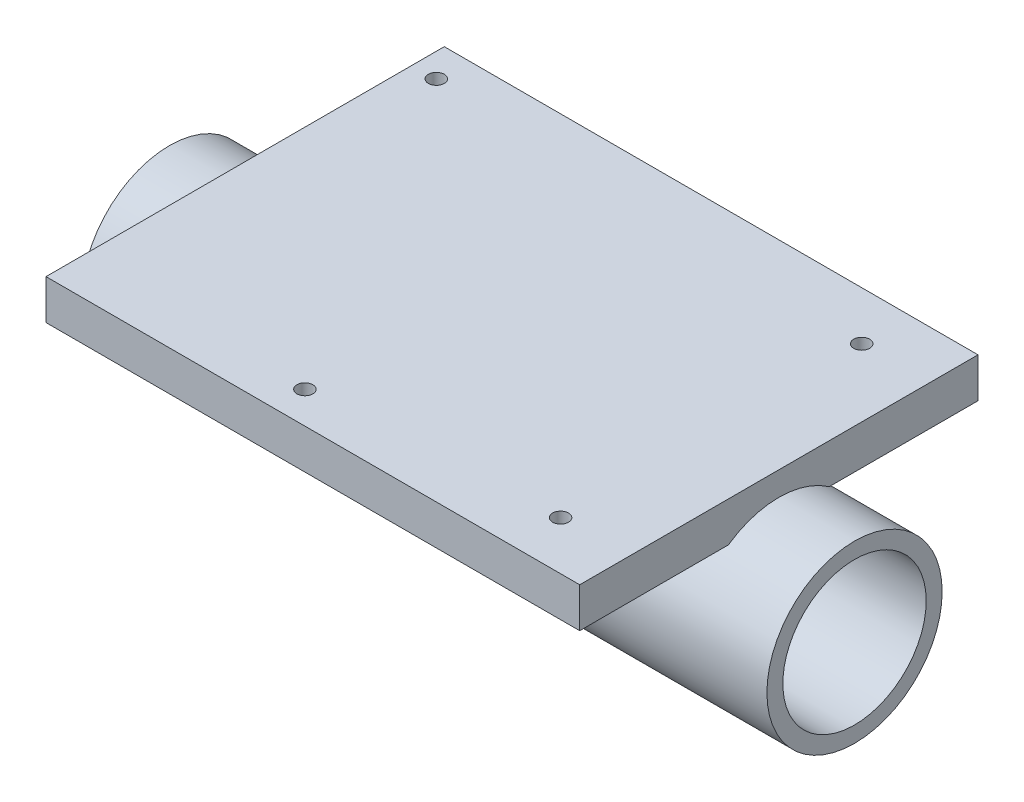
ISO-10303-21;
HEADER;
FILE_DESCRIPTION(('STEP AP214'),'2;1');
FILE_NAME('part.step','',(''),(''),'','','');
FILE_SCHEMA(('AUTOMOTIVE_DESIGN { 1 0 10303 214 1 1 1 1 }'));
ENDSEC;
DATA;
#1=APPLICATION_CONTEXT('core data for automotive mechanical design processes');
#2=APPLICATION_PROTOCOL_DEFINITION('international standard','automotive_design',2000,#1);
#3=PRODUCT_CONTEXT('',#1,'mechanical');
#4=PRODUCT('Part','Part','',(#3));
#5=PRODUCT_RELATED_PRODUCT_CATEGORY('part','',(#4));
#6=PRODUCT_DEFINITION_FORMATION('','',#4);
#7=PRODUCT_DEFINITION_CONTEXT('part definition',#1,'design');
#8=PRODUCT_DEFINITION('design','',#6,#7);
#9=PRODUCT_DEFINITION_SHAPE('','',#8);
#10=(LENGTH_UNIT() NAMED_UNIT(*) SI_UNIT(.MILLI.,.METRE.));
#11=(NAMED_UNIT(*) PLANE_ANGLE_UNIT() SI_UNIT($,.RADIAN.));
#12=(NAMED_UNIT(*) SI_UNIT($,.STERADIAN.) SOLID_ANGLE_UNIT());
#13=UNCERTAINTY_MEASURE_WITH_UNIT(LENGTH_MEASURE(1.E-05),#10,'distance_accuracy_value','');
#14=(GEOMETRIC_REPRESENTATION_CONTEXT(3) GLOBAL_UNCERTAINTY_ASSIGNED_CONTEXT((#13)) GLOBAL_UNIT_ASSIGNED_CONTEXT((#10,
#11,#12)) REPRESENTATION_CONTEXT('',''));
#15=CARTESIAN_POINT('',(0.,0.,0.));
#16=DIRECTION('',(0.,0.,1.));
#17=DIRECTION('',(1.,0.,0.));
#18=AXIS2_PLACEMENT_3D('',#15,#16,#17);
#19=CARTESIAN_POINT('',(43.,-9.,0.));
#20=DIRECTION('',(1.,0.,0.));
#21=DIRECTION('',(0.,0.,-1.));
#22=AXIS2_PLACEMENT_3D('',#19,#20,#21);
#23=PLANE('',#22);
#24=CARTESIAN_POINT('',(43.,-9.,0.));
#25=DIRECTION('',(1.,0.,0.));
#26=DIRECTION('',(0.,0.,-1.));
#27=AXIS2_PLACEMENT_3D('',#24,#25,#26);
#28=CIRCLE('',#27,11.);
#29=CARTESIAN_POINT('',(43.,-9.,-11.));
#30=VERTEX_POINT('',#29);
#31=EDGE_CURVE('E11',#30,#30,#28,.T.);
#32=ORIENTED_EDGE('',*,*,#31,.T.);
#33=EDGE_LOOP('',(#32));
#34=FACE_BOUND('',#33,.T.);
#35=CARTESIAN_POINT('',(43.,-9.,0.));
#36=DIRECTION('',(1.,0.,0.));
#37=DIRECTION('',(0.,0.,-1.));
#38=AXIS2_PLACEMENT_3D('',#35,#36,#37);
#39=CIRCLE('',#38,9.);
#40=CARTESIAN_POINT('',(43.,-9.,-9.));
#41=VERTEX_POINT('',#40);
#42=EDGE_CURVE('E58',#41,#41,#39,.T.);
#43=ORIENTED_EDGE('',*,*,#42,.F.);
#44=EDGE_LOOP('',(#43));
#45=FACE_BOUND('',#44,.T.);
#46=ADVANCED_FACE('F47',(#34,#45),#23,.T.);
#47=CARTESIAN_POINT('',(-43.,-9.,0.));
#48=DIRECTION('',(1.,0.,0.));
#49=DIRECTION('',(0.,0.,-1.));
#50=AXIS2_PLACEMENT_3D('',#47,#48,#49);
#51=PLANE('',#50);
#52=CARTESIAN_POINT('',(-43.,-9.,0.));
#53=DIRECTION('',(1.,0.,0.));
#54=DIRECTION('',(0.,0.,-1.));
#55=AXIS2_PLACEMENT_3D('',#52,#53,#54);
#56=CIRCLE('',#55,11.);
#57=CARTESIAN_POINT('',(-43.,-9.,-11.));
#58=VERTEX_POINT('',#57);
#59=EDGE_CURVE('E51',#58,#58,#56,.T.);
#60=ORIENTED_EDGE('',*,*,#59,.F.);
#61=EDGE_LOOP('',(#60));
#62=FACE_BOUND('',#61,.T.);
#63=CARTESIAN_POINT('',(-43.,-9.,0.));
#64=DIRECTION('',(1.,0.,0.));
#65=DIRECTION('',(0.,0.,-1.));
#66=AXIS2_PLACEMENT_3D('',#63,#64,#65);
#67=CIRCLE('',#66,9.);
#68=CARTESIAN_POINT('',(-43.,-9.,-9.));
#69=VERTEX_POINT('',#68);
#70=EDGE_CURVE('E60',#69,#69,#67,.T.);
#71=ORIENTED_EDGE('',*,*,#70,.T.);
#72=EDGE_LOOP('',(#71));
#73=FACE_BOUND('',#72,.T.);
#74=ADVANCED_FACE('F70',(#62,#73),#51,.F.);
#75=CARTESIAN_POINT('',(43.,-9.,0.));
#76=DIRECTION('',(-1.,0.,0.));
#77=DIRECTION('',(0.,0.,1.));
#78=AXIS2_PLACEMENT_3D('',#75,#76,#77);
#79=CYLINDRICAL_SURFACE('',#78,11.);
#80=ORIENTED_EDGE('',*,*,#31,.F.);
#81=EDGE_LOOP('',(#80));
#82=FACE_BOUND('',#81,.T.);
#83=ORIENTED_EDGE('',*,*,#59,.T.);
#84=EDGE_LOOP('',(#83));
#85=FACE_BOUND('',#84,.T.);
#86=ADVANCED_FACE('F49',(#82,#85),#79,.T.);
#87=CARTESIAN_POINT('',(43.,-9.,0.));
#88=DIRECTION('',(-1.,0.,0.));
#89=DIRECTION('',(0.,0.,1.));
#90=AXIS2_PLACEMENT_3D('',#87,#88,#89);
#91=CYLINDRICAL_SURFACE('',#90,9.);
#92=ORIENTED_EDGE('',*,*,#42,.T.);
#93=EDGE_LOOP('',(#92));
#94=FACE_BOUND('',#93,.T.);
#95=ORIENTED_EDGE('',*,*,#70,.F.);
#96=EDGE_LOOP('',(#95));
#97=FACE_BOUND('',#96,.T.);
#98=ADVANCED_FACE('F66',(#94,#97),#91,.F.);
#99=CLOSED_SHELL('',(#46,#74,#86,#98));
#100=MANIFOLD_SOLID_BREP('B2',#99);
#101=CARTESIAN_POINT('',(33.5,5.,25.));
#102=DIRECTION('',(-1.,0.,0.));
#103=DIRECTION('',(0.,0.,1.));
#104=AXIS2_PLACEMENT_3D('',#101,#102,#103);
#105=PLANE('',#104);
#106=DIRECTION('',(0.,0.,-1.));
#107=VECTOR('',#106,1.);
#108=CARTESIAN_POINT('',(33.5,0.,25.));
#109=LINE('',#108,#107);
#110=CARTESIAN_POINT('',(33.5,0.,25.));
#111=VERTEX_POINT('',#110);
#112=CARTESIAN_POINT('',(33.5,0.,-25.));
#113=VERTEX_POINT('',#112);
#114=EDGE_CURVE('E180',#111,#113,#109,.T.);
#115=ORIENTED_EDGE('',*,*,#114,.T.);
#116=DIRECTION('',(0.,-1.,0.));
#117=VECTOR('',#116,1.);
#118=CARTESIAN_POINT('',(33.5,5.,-25.));
#119=LINE('',#118,#117);
#120=CARTESIAN_POINT('',(33.5,5.,-25.));
#121=VERTEX_POINT('',#120);
#122=EDGE_CURVE('E45',#121,#113,#119,.T.);
#123=ORIENTED_EDGE('',*,*,#122,.F.);
#124=DIRECTION('',(0.,0.,-1.));
#125=VECTOR('',#124,1.);
#126=CARTESIAN_POINT('',(33.5,5.,25.));
#127=LINE('',#126,#125);
#128=CARTESIAN_POINT('',(33.5,5.,25.));
#129=VERTEX_POINT('',#128);
#130=EDGE_CURVE('E168',#129,#121,#127,.T.);
#131=ORIENTED_EDGE('',*,*,#130,.F.);
#132=DIRECTION('',(0.,-1.,0.));
#133=VECTOR('',#132,1.);
#134=CARTESIAN_POINT('',(33.5,5.,25.));
#135=LINE('',#134,#133);
#136=EDGE_CURVE('E176',#129,#111,#135,.T.);
#137=ORIENTED_EDGE('',*,*,#136,.T.);
#138=EDGE_LOOP('',(#115,#123,#131,#137));
#139=FACE_BOUND('',#138,.T.);
#140=ADVANCED_FACE('F117',(#139),#105,.F.);
#141=CARTESIAN_POINT('',(-33.5,5.,-25.));
#142=DIRECTION('',(0.,0.,1.));
#143=DIRECTION('',(1.,0.,0.));
#144=AXIS2_PLACEMENT_3D('',#141,#142,#143);
#145=PLANE('',#144);
#146=DIRECTION('',(-1.,0.,0.));
#147=VECTOR('',#146,1.);
#148=CARTESIAN_POINT('',(-33.5,0.,-25.));
#149=LINE('',#148,#147);
#150=CARTESIAN_POINT('',(-33.5,0.,-25.));
#151=VERTEX_POINT('',#150);
#152=EDGE_CURVE('E172',#113,#151,#149,.T.);
#153=ORIENTED_EDGE('',*,*,#152,.T.);
#154=DIRECTION('',(0.,-1.,0.));
#155=VECTOR('',#154,1.);
#156=CARTESIAN_POINT('',(-33.5,5.,-25.));
#157=LINE('',#156,#155);
#158=CARTESIAN_POINT('',(-33.5,5.,-25.));
#159=VERTEX_POINT('',#158);
#160=EDGE_CURVE('E125',#159,#151,#157,.T.);
#161=ORIENTED_EDGE('',*,*,#160,.F.);
#162=DIRECTION('',(-1.,0.,0.));
#163=VECTOR('',#162,1.);
#164=CARTESIAN_POINT('',(-33.5,5.,-25.));
#165=LINE('',#164,#163);
#166=EDGE_CURVE('E163',#121,#159,#165,.T.);
#167=ORIENTED_EDGE('',*,*,#166,.F.);
#168=ORIENTED_EDGE('',*,*,#122,.T.);
#169=EDGE_LOOP('',(#153,#161,#167,#168));
#170=FACE_BOUND('',#169,.T.);
#171=ADVANCED_FACE('F171',(#170),#145,.F.);
#172=CARTESIAN_POINT('',(-33.5,5.,25.));
#173=DIRECTION('',(1.,0.,0.));
#174=DIRECTION('',(0.,0.,-1.));
#175=AXIS2_PLACEMENT_3D('',#172,#173,#174);
#176=PLANE('',#175);
#177=DIRECTION('',(0.,0.,1.));
#178=VECTOR('',#177,1.);
#179=CARTESIAN_POINT('',(-33.5,0.,25.));
#180=LINE('',#179,#178);
#181=CARTESIAN_POINT('',(-33.5,0.,25.));
#182=VERTEX_POINT('',#181);
#183=EDGE_CURVE('E150',#151,#182,#180,.T.);
#184=ORIENTED_EDGE('',*,*,#183,.T.);
#185=DIRECTION('',(0.,-1.,0.));
#186=VECTOR('',#185,1.);
#187=CARTESIAN_POINT('',(-33.5,5.,25.));
#188=LINE('',#187,#186);
#189=CARTESIAN_POINT('',(-33.5,5.,25.));
#190=VERTEX_POINT('',#189);
#191=EDGE_CURVE('E173',#190,#182,#188,.T.);
#192=ORIENTED_EDGE('',*,*,#191,.F.);
#193=DIRECTION('',(0.,0.,1.));
#194=VECTOR('',#193,1.);
#195=CARTESIAN_POINT('',(-33.5,5.,25.));
#196=LINE('',#195,#194);
#197=EDGE_CURVE('E166',#159,#190,#196,.T.);
#198=ORIENTED_EDGE('',*,*,#197,.F.);
#199=ORIENTED_EDGE('',*,*,#160,.T.);
#200=EDGE_LOOP('',(#184,#192,#198,#199));
#201=FACE_BOUND('',#200,.T.);
#202=ADVANCED_FACE('F174',(#201),#176,.F.);
#203=CARTESIAN_POINT('',(-33.5,5.,25.));
#204=DIRECTION('',(0.,0.,-1.));
#205=DIRECTION('',(-1.,0.,0.));
#206=AXIS2_PLACEMENT_3D('',#203,#204,#205);
#207=PLANE('',#206);
#208=DIRECTION('',(1.,0.,0.));
#209=VECTOR('',#208,1.);
#210=CARTESIAN_POINT('',(-33.5,0.,25.));
#211=LINE('',#210,#209);
#212=EDGE_CURVE('E156',#182,#111,#211,.T.);
#213=ORIENTED_EDGE('',*,*,#212,.T.);
#214=ORIENTED_EDGE('',*,*,#136,.F.);
#215=DIRECTION('',(1.,0.,0.));
#216=VECTOR('',#215,1.);
#217=CARTESIAN_POINT('',(-33.5,5.,25.));
#218=LINE('',#217,#216);
#219=EDGE_CURVE('E133',#190,#129,#218,.T.);
#220=ORIENTED_EDGE('',*,*,#219,.F.);
#221=ORIENTED_EDGE('',*,*,#191,.T.);
#222=EDGE_LOOP('',(#213,#214,#220,#221));
#223=FACE_BOUND('',#222,.T.);
#224=ADVANCED_FACE('F188',(#223),#207,.F.);
#225=CARTESIAN_POINT('',(0.,5.,0.));
#226=DIRECTION('',(0.,-1.,0.));
#227=DIRECTION('',(0.,0.,-1.));
#228=AXIS2_PLACEMENT_3D('',#225,#226,#227);
#229=PLANE('',#228);
#230=CARTESIAN_POINT('',(-4.99999999999999,5.,21.));
#231=DIRECTION('',(0.,1.,0.));
#232=DIRECTION('',(0.,0.,1.));
#233=AXIS2_PLACEMENT_3D('',#230,#231,#232);
#234=CIRCLE('',#233,1.);
#235=CARTESIAN_POINT('',(-4.99999999999999,5.,22.));
#236=VERTEX_POINT('',#235);
#237=EDGE_CURVE('E212',#236,#236,#234,.T.);
#238=ORIENTED_EDGE('',*,*,#237,.F.);
#239=EDGE_LOOP('',(#238));
#240=FACE_BOUND('',#239,.T.);
#241=CARTESIAN_POINT('',(25.,5.,18.9));
#242=DIRECTION('',(0.,1.,0.));
#243=DIRECTION('',(0.,0.,1.));
#244=AXIS2_PLACEMENT_3D('',#241,#242,#243);
#245=CIRCLE('',#244,1.);
#246=CARTESIAN_POINT('',(25.,5.,19.9));
#247=VERTEX_POINT('',#246);
#248=EDGE_CURVE('E209',#247,#247,#245,.T.);
#249=ORIENTED_EDGE('',*,*,#248,.F.);
#250=EDGE_LOOP('',(#249));
#251=FACE_BOUND('',#250,.T.);
#252=CARTESIAN_POINT('',(25.,5.,-18.9));
#253=DIRECTION('',(0.,1.,0.));
#254=DIRECTION('',(0.,0.,-1.));
#255=AXIS2_PLACEMENT_3D('',#252,#253,#254);
#256=CIRCLE('',#255,1.);
#257=CARTESIAN_POINT('',(25.,5.,-19.9));
#258=VERTEX_POINT('',#257);
#259=EDGE_CURVE('E203',#258,#258,#256,.T.);
#260=ORIENTED_EDGE('',*,*,#259,.F.);
#261=EDGE_LOOP('',(#260));
#262=FACE_BOUND('',#261,.T.);
#263=CARTESIAN_POINT('',(-30.5,5.,-21.));
#264=DIRECTION('',(0.,1.,0.));
#265=DIRECTION('',(0.,0.,1.));
#266=AXIS2_PLACEMENT_3D('',#263,#264,#265);
#267=CIRCLE('',#266,1.);
#268=CARTESIAN_POINT('',(-30.5,5.,-20.));
#269=VERTEX_POINT('',#268);
#270=EDGE_CURVE('E197',#269,#269,#267,.T.);
#271=ORIENTED_EDGE('',*,*,#270,.F.);
#272=EDGE_LOOP('',(#271));
#273=FACE_BOUND('',#272,.T.);
#274=ORIENTED_EDGE('',*,*,#130,.T.);
#275=ORIENTED_EDGE('',*,*,#166,.T.);
#276=ORIENTED_EDGE('',*,*,#197,.T.);
#277=ORIENTED_EDGE('',*,*,#219,.T.);
#278=EDGE_LOOP('',(#274,#275,#276,#277));
#279=FACE_BOUND('',#278,.T.);
#280=ADVANCED_FACE('F164',(#240,#251,#262,#273,#279),#229,.F.);
#281=CARTESIAN_POINT('',(0.,0.,0.));
#282=DIRECTION('',(0.,-1.,0.));
#283=DIRECTION('',(0.,0.,-1.));
#284=AXIS2_PLACEMENT_3D('',#281,#282,#283);
#285=PLANE('',#284);
#286=CARTESIAN_POINT('',(-4.99999999999999,0.,21.));
#287=DIRECTION('',(0.,1.,0.));
#288=DIRECTION('',(0.,0.,1.));
#289=AXIS2_PLACEMENT_3D('',#286,#287,#288);
#290=CIRCLE('',#289,1.);
#291=CARTESIAN_POINT('',(-4.99999999999999,0.,22.));
#292=VERTEX_POINT('',#291);
#293=EDGE_CURVE('E183',#292,#292,#290,.T.);
#294=ORIENTED_EDGE('',*,*,#293,.T.);
#295=EDGE_LOOP('',(#294));
#296=FACE_BOUND('',#295,.T.);
#297=CARTESIAN_POINT('',(25.,0.,18.9));
#298=DIRECTION('',(0.,1.,0.));
#299=DIRECTION('',(0.,0.,1.));
#300=AXIS2_PLACEMENT_3D('',#297,#298,#299);
#301=CIRCLE('',#300,1.);
#302=CARTESIAN_POINT('',(25.,0.,19.9));
#303=VERTEX_POINT('',#302);
#304=EDGE_CURVE('E206',#303,#303,#301,.T.);
#305=ORIENTED_EDGE('',*,*,#304,.T.);
#306=EDGE_LOOP('',(#305));
#307=FACE_BOUND('',#306,.T.);
#308=CARTESIAN_POINT('',(25.,0.,-18.9));
#309=DIRECTION('',(0.,1.,0.));
#310=DIRECTION('',(0.,0.,-1.));
#311=AXIS2_PLACEMENT_3D('',#308,#309,#310);
#312=CIRCLE('',#311,1.);
#313=CARTESIAN_POINT('',(25.,0.,-19.9));
#314=VERTEX_POINT('',#313);
#315=EDGE_CURVE('E200',#314,#314,#312,.T.);
#316=ORIENTED_EDGE('',*,*,#315,.T.);
#317=EDGE_LOOP('',(#316));
#318=FACE_BOUND('',#317,.T.);
#319=CARTESIAN_POINT('',(-30.5,0.,-21.));
#320=DIRECTION('',(0.,1.,0.));
#321=DIRECTION('',(0.,0.,1.));
#322=AXIS2_PLACEMENT_3D('',#319,#320,#321);
#323=CIRCLE('',#322,1.);
#324=CARTESIAN_POINT('',(-30.5,0.,-20.));
#325=VERTEX_POINT('',#324);
#326=EDGE_CURVE('E194',#325,#325,#323,.T.);
#327=ORIENTED_EDGE('',*,*,#326,.T.);
#328=EDGE_LOOP('',(#327));
#329=FACE_BOUND('',#328,.T.);
#330=ORIENTED_EDGE('',*,*,#114,.F.);
#331=ORIENTED_EDGE('',*,*,#212,.F.);
#332=ORIENTED_EDGE('',*,*,#183,.F.);
#333=ORIENTED_EDGE('',*,*,#152,.F.);
#334=EDGE_LOOP('',(#330,#331,#332,#333));
#335=FACE_BOUND('',#334,.T.);
#336=ADVANCED_FACE('F191',(#296,#307,#318,#329,#335),#285,.T.);
#337=CARTESIAN_POINT('',(-30.5,0.,-21.));
#338=DIRECTION('',(0.,1.,0.));
#339=DIRECTION('',(0.,0.,1.));
#340=AXIS2_PLACEMENT_3D('',#337,#338,#339);
#341=CYLINDRICAL_SURFACE('',#340,1.);
#342=ORIENTED_EDGE('',*,*,#326,.F.);
#343=EDGE_LOOP('',(#342));
#344=FACE_BOUND('',#343,.T.);
#345=ORIENTED_EDGE('',*,*,#270,.T.);
#346=EDGE_LOOP('',(#345));
#347=FACE_BOUND('',#346,.T.);
#348=ADVANCED_FACE('F236',(#344,#347),#341,.F.);
#349=CARTESIAN_POINT('',(25.,0.,-18.9));
#350=DIRECTION('',(0.,1.,0.));
#351=DIRECTION('',(0.,0.,1.));
#352=AXIS2_PLACEMENT_3D('',#349,#350,#351);
#353=CYLINDRICAL_SURFACE('',#352,1.);
#354=ORIENTED_EDGE('',*,*,#315,.F.);
#355=EDGE_LOOP('',(#354));
#356=FACE_BOUND('',#355,.T.);
#357=ORIENTED_EDGE('',*,*,#259,.T.);
#358=EDGE_LOOP('',(#357));
#359=FACE_BOUND('',#358,.T.);
#360=ADVANCED_FACE('F238',(#356,#359),#353,.F.);
#361=CARTESIAN_POINT('',(25.,0.,18.9));
#362=DIRECTION('',(0.,1.,0.));
#363=DIRECTION('',(0.,0.,1.));
#364=AXIS2_PLACEMENT_3D('',#361,#362,#363);
#365=CYLINDRICAL_SURFACE('',#364,1.);
#366=ORIENTED_EDGE('',*,*,#304,.F.);
#367=EDGE_LOOP('',(#366));
#368=FACE_BOUND('',#367,.T.);
#369=ORIENTED_EDGE('',*,*,#248,.T.);
#370=EDGE_LOOP('',(#369));
#371=FACE_BOUND('',#370,.T.);
#372=ADVANCED_FACE('F223',(#368,#371),#365,.F.);
#373=CARTESIAN_POINT('',(-4.99999999999999,0.,21.));
#374=DIRECTION('',(0.,1.,0.));
#375=DIRECTION('',(0.,0.,1.));
#376=AXIS2_PLACEMENT_3D('',#373,#374,#375);
#377=CYLINDRICAL_SURFACE('',#376,1.);
#378=ORIENTED_EDGE('',*,*,#293,.F.);
#379=EDGE_LOOP('',(#378));
#380=FACE_BOUND('',#379,.T.);
#381=ORIENTED_EDGE('',*,*,#237,.T.);
#382=EDGE_LOOP('',(#381));
#383=FACE_BOUND('',#382,.T.);
#384=ADVANCED_FACE('F220',(#380,#383),#377,.F.);
#385=CLOSED_SHELL('',(#140,#171,#202,#224,#280,#336,#348,#360,#372,#384));
#386=MANIFOLD_SOLID_BREP('B6',#385);
#387=ADVANCED_BREP_SHAPE_REPRESENTATION('',(#18,#100,#386),#14);
#388=SHAPE_DEFINITION_REPRESENTATION(#9,#387);
ENDSEC;
END-ISO-10303-21;
